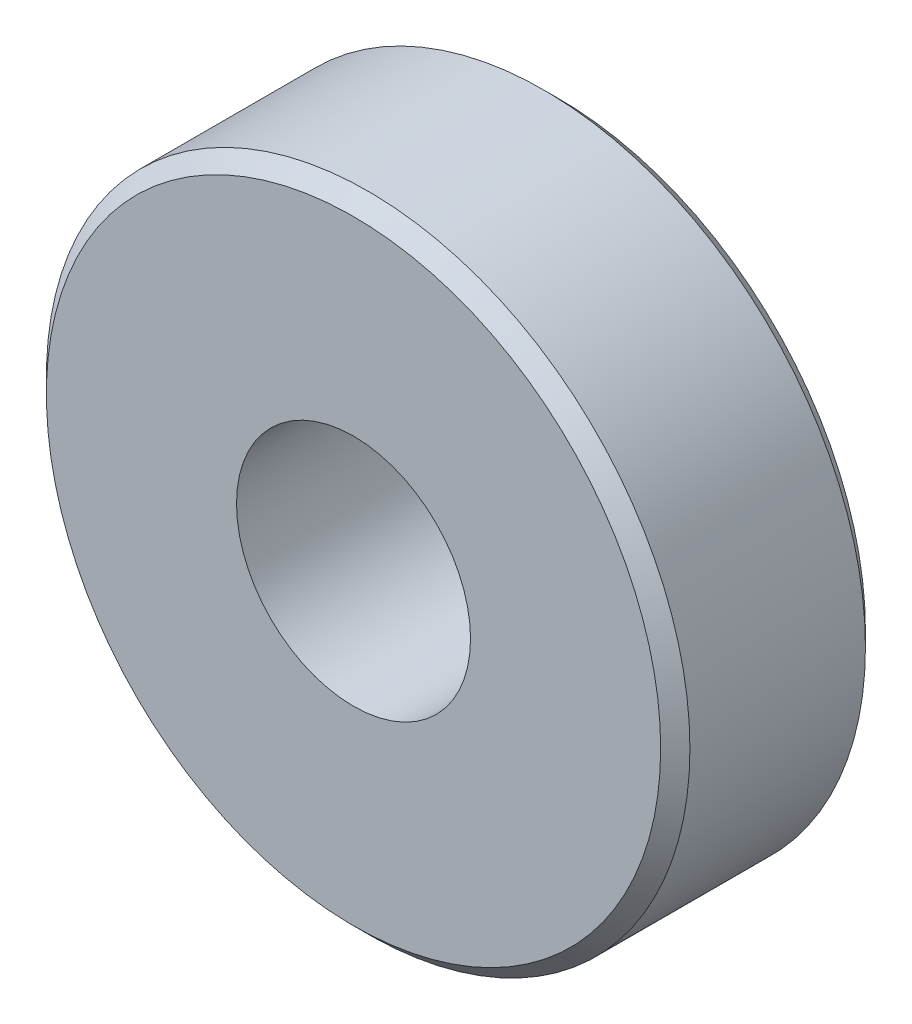
ISO-10303-21;
HEADER;
FILE_DESCRIPTION(('STEP AP214'),'2;1');
FILE_NAME('part.step','',(''),(''),'','','');
FILE_SCHEMA(('AUTOMOTIVE_DESIGN { 1 0 10303 214 1 1 1 1 }'));
ENDSEC;
DATA;
#1=APPLICATION_CONTEXT('core data for automotive mechanical design processes');
#2=APPLICATION_PROTOCOL_DEFINITION('international standard','automotive_design',2000,#1);
#3=PRODUCT_CONTEXT('',#1,'mechanical');
#4=PRODUCT('Part','Part','',(#3));
#5=PRODUCT_RELATED_PRODUCT_CATEGORY('part','',(#4));
#6=PRODUCT_DEFINITION_FORMATION('','',#4);
#7=PRODUCT_DEFINITION_CONTEXT('part definition',#1,'design');
#8=PRODUCT_DEFINITION('design','',#6,#7);
#9=PRODUCT_DEFINITION_SHAPE('','',#8);
#10=(LENGTH_UNIT() NAMED_UNIT(*) SI_UNIT(.MILLI.,.METRE.));
#11=(NAMED_UNIT(*) PLANE_ANGLE_UNIT() SI_UNIT($,.RADIAN.));
#12=(NAMED_UNIT(*) SI_UNIT($,.STERADIAN.) SOLID_ANGLE_UNIT());
#13=UNCERTAINTY_MEASURE_WITH_UNIT(LENGTH_MEASURE(1.E-05),#10,'distance_accuracy_value','');
#14=(GEOMETRIC_REPRESENTATION_CONTEXT(3) GLOBAL_UNCERTAINTY_ASSIGNED_CONTEXT((#13)) GLOBAL_UNIT_ASSIGNED_CONTEXT((#10,
#11,#12)) REPRESENTATION_CONTEXT('',''));
#15=CARTESIAN_POINT('',(0.,0.,0.));
#16=DIRECTION('',(0.,0.,1.));
#17=DIRECTION('',(1.,0.,0.));
#18=AXIS2_PLACEMENT_3D('',#15,#16,#17);
#19=CARTESIAN_POINT('',(0.,0.,7.));
#20=DIRECTION('',(0.,0.,1.));
#21=DIRECTION('',(1.,0.,0.));
#22=AXIS2_PLACEMENT_3D('',#19,#20,#21);
#23=PLANE('',#22);
#24=CARTESIAN_POINT('',(0.,0.,7.));
#25=DIRECTION('',(0.,0.,1.));
#26=DIRECTION('',(1.,0.,0.));
#27=AXIS2_PLACEMENT_3D('',#24,#25,#26);
#28=CIRCLE('',#27,10.5);
#29=CARTESIAN_POINT('',(10.5,0.,7.));
#30=VERTEX_POINT('',#29);
#31=EDGE_CURVE('E10',#30,#30,#28,.T.);
#32=ORIENTED_EDGE('',*,*,#31,.T.);
#33=EDGE_LOOP('',(#32));
#34=FACE_BOUND('',#33,.T.);
#35=CARTESIAN_POINT('',(0.,0.,7.));
#36=DIRECTION('',(0.,0.,1.));
#37=DIRECTION('',(1.,0.,0.));
#38=AXIS2_PLACEMENT_3D('',#35,#36,#37);
#39=CIRCLE('',#38,4.);
#40=CARTESIAN_POINT('',(4.,0.,7.));
#41=VERTEX_POINT('',#40);
#42=EDGE_CURVE('E51',#41,#41,#39,.T.);
#43=ORIENTED_EDGE('',*,*,#42,.F.);
#44=EDGE_LOOP('',(#43));
#45=FACE_BOUND('',#44,.T.);
#46=ADVANCED_FACE('F31',(#34,#45),#23,.T.);
#47=CARTESIAN_POINT('',(0.,0.,0.));
#48=DIRECTION('',(0.,0.,1.));
#49=DIRECTION('',(1.,0.,0.));
#50=AXIS2_PLACEMENT_3D('',#47,#48,#49);
#51=PLANE('',#50);
#52=CARTESIAN_POINT('',(0.,0.,0.));
#53=DIRECTION('',(0.,0.,1.));
#54=DIRECTION('',(1.,0.,0.));
#55=AXIS2_PLACEMENT_3D('',#52,#53,#54);
#56=CIRCLE('',#55,10.5);
#57=CARTESIAN_POINT('',(10.5,0.,0.));
#58=VERTEX_POINT('',#57);
#59=EDGE_CURVE('E38',#58,#58,#56,.F.);
#60=ORIENTED_EDGE('',*,*,#59,.T.);
#61=EDGE_LOOP('',(#60));
#62=FACE_BOUND('',#61,.T.);
#63=CARTESIAN_POINT('',(0.,0.,0.));
#64=DIRECTION('',(0.,0.,1.));
#65=DIRECTION('',(1.,0.,0.));
#66=AXIS2_PLACEMENT_3D('',#63,#64,#65);
#67=CIRCLE('',#66,4.);
#68=CARTESIAN_POINT('',(4.,0.,0.));
#69=VERTEX_POINT('',#68);
#70=EDGE_CURVE('E52',#69,#69,#67,.T.);
#71=ORIENTED_EDGE('',*,*,#70,.T.);
#72=EDGE_LOOP('',(#71));
#73=FACE_BOUND('',#72,.T.);
#74=ADVANCED_FACE('F62',(#62,#73),#51,.F.);
#75=CARTESIAN_POINT('',(0.,0.,7.));
#76=DIRECTION('',(0.,0.,-1.));
#77=DIRECTION('',(-1.,0.,0.));
#78=AXIS2_PLACEMENT_3D('',#75,#76,#77);
#79=CYLINDRICAL_SURFACE('',#78,11.);
#80=CARTESIAN_POINT('',(0.,0.,0.499999999999997));
#81=DIRECTION('',(0.,0.,1.));
#82=DIRECTION('',(1.,0.,0.));
#83=AXIS2_PLACEMENT_3D('',#80,#81,#82);
#84=CIRCLE('',#83,11.);
#85=CARTESIAN_POINT('',(11.,0.,0.499999999999997));
#86=VERTEX_POINT('',#85);
#87=EDGE_CURVE('E42',#86,#86,#84,.T.);
#88=ORIENTED_EDGE('',*,*,#87,.T.);
#89=EDGE_LOOP('',(#88));
#90=FACE_BOUND('',#89,.T.);
#91=CARTESIAN_POINT('',(0.,0.,6.50000000000001));
#92=DIRECTION('',(0.,0.,1.));
#93=DIRECTION('',(1.,0.,0.));
#94=AXIS2_PLACEMENT_3D('',#91,#92,#93);
#95=CIRCLE('',#94,11.);
#96=CARTESIAN_POINT('',(11.,0.,6.50000000000001));
#97=VERTEX_POINT('',#96);
#98=EDGE_CURVE('E46',#97,#97,#95,.F.);
#99=ORIENTED_EDGE('',*,*,#98,.T.);
#100=EDGE_LOOP('',(#99));
#101=FACE_BOUND('',#100,.T.);
#102=ADVANCED_FACE('F67',(#90,#101),#79,.T.);
#103=CARTESIAN_POINT('',(0.,0.,7.));
#104=DIRECTION('',(0.,0.,-1.));
#105=DIRECTION('',(-1.,0.,0.));
#106=AXIS2_PLACEMENT_3D('',#103,#104,#105);
#107=CYLINDRICAL_SURFACE('',#106,4.);
#108=ORIENTED_EDGE('',*,*,#42,.T.);
#109=EDGE_LOOP('',(#108));
#110=FACE_BOUND('',#109,.T.);
#111=ORIENTED_EDGE('',*,*,#70,.F.);
#112=EDGE_LOOP('',(#111));
#113=FACE_BOUND('',#112,.T.);
#114=ADVANCED_FACE('F58',(#110,#113),#107,.F.);
#115=CARTESIAN_POINT('',(0.,0.,0.499999999999997));
#116=DIRECTION('',(0.,0.,1.));
#117=DIRECTION('',(1.,0.,0.));
#118=AXIS2_PLACEMENT_3D('',#115,#116,#117);
#119=CONICAL_SURFACE('',#118,11.,0.785398163397452);
#120=ORIENTED_EDGE('',*,*,#59,.F.);
#121=EDGE_LOOP('',(#120));
#122=FACE_BOUND('',#121,.T.);
#123=ORIENTED_EDGE('',*,*,#87,.F.);
#124=EDGE_LOOP('',(#123));
#125=FACE_BOUND('',#124,.T.);
#126=ADVANCED_FACE('F73',(#122,#125),#119,.T.);
#127=CARTESIAN_POINT('',(0.,0.,7.));
#128=DIRECTION('',(0.,0.,-1.));
#129=DIRECTION('',(-1.,0.,0.));
#130=AXIS2_PLACEMENT_3D('',#127,#128,#129);
#131=CONICAL_SURFACE('',#130,10.5,0.785398163397448);
#132=ORIENTED_EDGE('',*,*,#98,.F.);
#133=EDGE_LOOP('',(#132));
#134=FACE_BOUND('',#133,.T.);
#135=ORIENTED_EDGE('',*,*,#31,.F.);
#136=EDGE_LOOP('',(#135));
#137=FACE_BOUND('',#136,.T.);
#138=ADVANCED_FACE('F33',(#134,#137),#131,.T.);
#139=CLOSED_SHELL('',(#46,#74,#102,#114,#126,#138));
#140=MANIFOLD_SOLID_BREP('B2',#139);
#141=ADVANCED_BREP_SHAPE_REPRESENTATION('',(#18,#140),#14);
#142=SHAPE_DEFINITION_REPRESENTATION(#9,#141);
ENDSEC;
END-ISO-10303-21;
